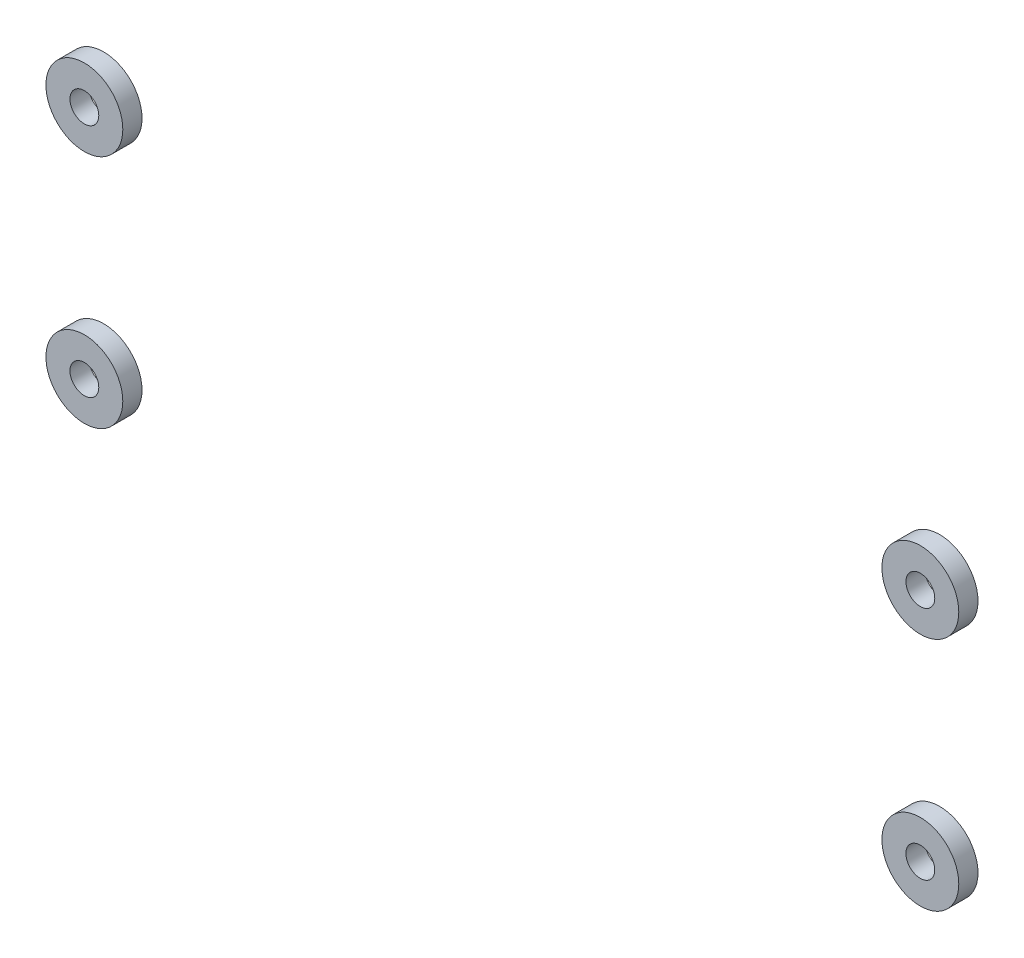
ISO-10303-21;
HEADER;
FILE_DESCRIPTION(('STEP AP214'),'2;1');
FILE_NAME('part.step','',(''),(''),'','','');
FILE_SCHEMA(('AUTOMOTIVE_DESIGN { 1 0 10303 214 1 1 1 1 }'));
ENDSEC;
DATA;
#1=APPLICATION_CONTEXT('core data for automotive mechanical design processes');
#2=APPLICATION_PROTOCOL_DEFINITION('international standard','automotive_design',2000,#1);
#3=PRODUCT_CONTEXT('',#1,'mechanical');
#4=PRODUCT('Part','Part','',(#3));
#5=PRODUCT_RELATED_PRODUCT_CATEGORY('part','',(#4));
#6=PRODUCT_DEFINITION_FORMATION('','',#4);
#7=PRODUCT_DEFINITION_CONTEXT('part definition',#1,'design');
#8=PRODUCT_DEFINITION('design','',#6,#7);
#9=PRODUCT_DEFINITION_SHAPE('','',#8);
#10=(LENGTH_UNIT() NAMED_UNIT(*) SI_UNIT(.MILLI.,.METRE.));
#11=(NAMED_UNIT(*) PLANE_ANGLE_UNIT() SI_UNIT($,.RADIAN.));
#12=(NAMED_UNIT(*) SI_UNIT($,.STERADIAN.) SOLID_ANGLE_UNIT());
#13=UNCERTAINTY_MEASURE_WITH_UNIT(LENGTH_MEASURE(1.E-05),#10,'distance_accuracy_value','');
#14=(GEOMETRIC_REPRESENTATION_CONTEXT(3) GLOBAL_UNCERTAINTY_ASSIGNED_CONTEXT((#13)) GLOBAL_UNIT_ASSIGNED_CONTEXT((#10,
#11,#12)) REPRESENTATION_CONTEXT('',''));
#15=CARTESIAN_POINT('',(0.,0.,0.));
#16=DIRECTION('',(0.,0.,1.));
#17=DIRECTION('',(1.,0.,0.));
#18=AXIS2_PLACEMENT_3D('',#15,#16,#17);
#19=CARTESIAN_POINT('',(-43.5,12.25,2.));
#20=DIRECTION('',(0.,0.,1.));
#21=DIRECTION('',(1.,0.,0.));
#22=AXIS2_PLACEMENT_3D('',#19,#20,#21);
#23=PLANE('',#22);
#24=CARTESIAN_POINT('',(-43.5,12.25,2.));
#25=DIRECTION('',(0.,0.,1.));
#26=DIRECTION('',(1.,0.,0.));
#27=AXIS2_PLACEMENT_3D('',#24,#25,#26);
#28=CIRCLE('',#27,4.);
#29=CARTESIAN_POINT('',(-39.5,12.25,2.));
#30=VERTEX_POINT('',#29);
#31=EDGE_CURVE('E56',#30,#30,#28,.T.);
#32=ORIENTED_EDGE('',*,*,#31,.T.);
#33=EDGE_LOOP('',(#32));
#34=FACE_BOUND('',#33,.T.);
#35=CARTESIAN_POINT('',(-43.5,12.25,2.));
#36=DIRECTION('',(0.,0.,1.));
#37=DIRECTION('',(1.,0.,0.));
#38=AXIS2_PLACEMENT_3D('',#35,#36,#37);
#39=CIRCLE('',#38,1.5);
#40=CARTESIAN_POINT('',(-42.,12.25,2.));
#41=VERTEX_POINT('',#40);
#42=EDGE_CURVE('E47',#41,#41,#39,.T.);
#43=ORIENTED_EDGE('',*,*,#42,.F.);
#44=EDGE_LOOP('',(#43));
#45=FACE_BOUND('',#44,.T.);
#46=ADVANCED_FACE('F43',(#34,#45),#23,.T.);
#47=CARTESIAN_POINT('',(-43.5,12.25,0.));
#48=DIRECTION('',(0.,0.,1.));
#49=DIRECTION('',(1.,0.,0.));
#50=AXIS2_PLACEMENT_3D('',#47,#48,#49);
#51=PLANE('',#50);
#52=CARTESIAN_POINT('',(-43.5,12.25,0.));
#53=DIRECTION('',(0.,0.,1.));
#54=DIRECTION('',(1.,0.,0.));
#55=AXIS2_PLACEMENT_3D('',#52,#53,#54);
#56=CIRCLE('',#55,4.);
#57=CARTESIAN_POINT('',(-39.5,12.25,0.));
#58=VERTEX_POINT('',#57);
#59=EDGE_CURVE('E54',#58,#58,#56,.T.);
#60=ORIENTED_EDGE('',*,*,#59,.F.);
#61=EDGE_LOOP('',(#60));
#62=FACE_BOUND('',#61,.T.);
#63=CARTESIAN_POINT('',(-43.5,12.25,0.));
#64=DIRECTION('',(0.,0.,1.));
#65=DIRECTION('',(1.,0.,0.));
#66=AXIS2_PLACEMENT_3D('',#63,#64,#65);
#67=CIRCLE('',#66,1.5);
#68=CARTESIAN_POINT('',(-42.,12.25,0.));
#69=VERTEX_POINT('',#68);
#70=EDGE_CURVE('E11',#69,#69,#67,.T.);
#71=ORIENTED_EDGE('',*,*,#70,.T.);
#72=EDGE_LOOP('',(#71));
#73=FACE_BOUND('',#72,.T.);
#74=ADVANCED_FACE('F64',(#62,#73),#51,.F.);
#75=CARTESIAN_POINT('',(-43.5,12.25,2.));
#76=DIRECTION('',(0.,0.,-1.));
#77=DIRECTION('',(-1.,0.,0.));
#78=AXIS2_PLACEMENT_3D('',#75,#76,#77);
#79=CYLINDRICAL_SURFACE('',#78,4.);
#80=ORIENTED_EDGE('',*,*,#31,.F.);
#81=EDGE_LOOP('',(#80));
#82=FACE_BOUND('',#81,.T.);
#83=ORIENTED_EDGE('',*,*,#59,.T.);
#84=EDGE_LOOP('',(#83));
#85=FACE_BOUND('',#84,.T.);
#86=ADVANCED_FACE('F62',(#82,#85),#79,.T.);
#87=CARTESIAN_POINT('',(-43.5,12.25,2.));
#88=DIRECTION('',(0.,0.,-1.));
#89=DIRECTION('',(-1.,0.,0.));
#90=AXIS2_PLACEMENT_3D('',#87,#88,#89);
#91=CYLINDRICAL_SURFACE('',#90,1.5);
#92=ORIENTED_EDGE('',*,*,#42,.T.);
#93=EDGE_LOOP('',(#92));
#94=FACE_BOUND('',#93,.T.);
#95=ORIENTED_EDGE('',*,*,#70,.F.);
#96=EDGE_LOOP('',(#95));
#97=FACE_BOUND('',#96,.T.);
#98=ADVANCED_FACE('F45',(#94,#97),#91,.F.);
#99=CLOSED_SHELL('',(#46,#74,#86,#98));
#100=MANIFOLD_SOLID_BREP('B2',#99);
#101=CARTESIAN_POINT('',(-43.5,-12.25,2.));
#102=DIRECTION('',(0.,0.,1.));
#103=DIRECTION('',(1.,0.,0.));
#104=AXIS2_PLACEMENT_3D('',#101,#102,#103);
#105=PLANE('',#104);
#106=CARTESIAN_POINT('',(-43.5,-12.25,2.));
#107=DIRECTION('',(0.,0.,1.));
#108=DIRECTION('',(1.,0.,0.));
#109=AXIS2_PLACEMENT_3D('',#106,#107,#108);
#110=CIRCLE('',#109,4.);
#111=CARTESIAN_POINT('',(-39.5,-12.25,2.));
#112=VERTEX_POINT('',#111);
#113=EDGE_CURVE('E133',#112,#112,#110,.T.);
#114=ORIENTED_EDGE('',*,*,#113,.T.);
#115=EDGE_LOOP('',(#114));
#116=FACE_BOUND('',#115,.T.);
#117=CARTESIAN_POINT('',(-43.5,-12.25,2.));
#118=DIRECTION('',(0.,0.,1.));
#119=DIRECTION('',(1.,0.,0.));
#120=AXIS2_PLACEMENT_3D('',#117,#118,#119);
#121=CIRCLE('',#120,1.5);
#122=CARTESIAN_POINT('',(-42.,-12.25,2.));
#123=VERTEX_POINT('',#122);
#124=EDGE_CURVE('E124',#123,#123,#121,.T.);
#125=ORIENTED_EDGE('',*,*,#124,.F.);
#126=EDGE_LOOP('',(#125));
#127=FACE_BOUND('',#126,.T.);
#128=ADVANCED_FACE('F120',(#116,#127),#105,.T.);
#129=CARTESIAN_POINT('',(-43.5,-12.25,0.));
#130=DIRECTION('',(0.,0.,1.));
#131=DIRECTION('',(1.,0.,0.));
#132=AXIS2_PLACEMENT_3D('',#129,#130,#131);
#133=PLANE('',#132);
#134=CARTESIAN_POINT('',(-43.5,-12.25,0.));
#135=DIRECTION('',(0.,0.,1.));
#136=DIRECTION('',(1.,0.,0.));
#137=AXIS2_PLACEMENT_3D('',#134,#135,#136);
#138=CIRCLE('',#137,4.);
#139=CARTESIAN_POINT('',(-39.5,-12.25,0.));
#140=VERTEX_POINT('',#139);
#141=EDGE_CURVE('E131',#140,#140,#138,.T.);
#142=ORIENTED_EDGE('',*,*,#141,.F.);
#143=EDGE_LOOP('',(#142));
#144=FACE_BOUND('',#143,.T.);
#145=CARTESIAN_POINT('',(-43.5,-12.25,0.));
#146=DIRECTION('',(0.,0.,1.));
#147=DIRECTION('',(1.,0.,0.));
#148=AXIS2_PLACEMENT_3D('',#145,#146,#147);
#149=CIRCLE('',#148,1.5);
#150=CARTESIAN_POINT('',(-42.,-12.25,0.));
#151=VERTEX_POINT('',#150);
#152=EDGE_CURVE('E42',#151,#151,#149,.T.);
#153=ORIENTED_EDGE('',*,*,#152,.T.);
#154=EDGE_LOOP('',(#153));
#155=FACE_BOUND('',#154,.T.);
#156=ADVANCED_FACE('F141',(#144,#155),#133,.F.);
#157=CARTESIAN_POINT('',(-43.5,-12.25,2.));
#158=DIRECTION('',(0.,0.,-1.));
#159=DIRECTION('',(-1.,0.,0.));
#160=AXIS2_PLACEMENT_3D('',#157,#158,#159);
#161=CYLINDRICAL_SURFACE('',#160,4.);
#162=ORIENTED_EDGE('',*,*,#113,.F.);
#163=EDGE_LOOP('',(#162));
#164=FACE_BOUND('',#163,.T.);
#165=ORIENTED_EDGE('',*,*,#141,.T.);
#166=EDGE_LOOP('',(#165));
#167=FACE_BOUND('',#166,.T.);
#168=ADVANCED_FACE('F139',(#164,#167),#161,.T.);
#169=CARTESIAN_POINT('',(-43.5,-12.25,2.));
#170=DIRECTION('',(0.,0.,-1.));
#171=DIRECTION('',(-1.,0.,0.));
#172=AXIS2_PLACEMENT_3D('',#169,#170,#171);
#173=CYLINDRICAL_SURFACE('',#172,1.5);
#174=ORIENTED_EDGE('',*,*,#124,.T.);
#175=EDGE_LOOP('',(#174));
#176=FACE_BOUND('',#175,.T.);
#177=ORIENTED_EDGE('',*,*,#152,.F.);
#178=EDGE_LOOP('',(#177));
#179=FACE_BOUND('',#178,.T.);
#180=ADVANCED_FACE('F122',(#176,#179),#173,.F.);
#181=CLOSED_SHELL('',(#128,#156,#168,#180));
#182=MANIFOLD_SOLID_BREP('B6',#181);
#183=CARTESIAN_POINT('',(43.5,12.25,2.));
#184=DIRECTION('',(0.,0.,1.));
#185=DIRECTION('',(1.,0.,0.));
#186=AXIS2_PLACEMENT_3D('',#183,#184,#185);
#187=PLANE('',#186);
#188=CARTESIAN_POINT('',(43.5,12.25,2.));
#189=DIRECTION('',(0.,0.,1.));
#190=DIRECTION('',(1.,0.,0.));
#191=AXIS2_PLACEMENT_3D('',#188,#189,#190);
#192=CIRCLE('',#191,4.);
#193=CARTESIAN_POINT('',(47.5,12.25,2.));
#194=VERTEX_POINT('',#193);
#195=EDGE_CURVE('E209',#194,#194,#192,.T.);
#196=ORIENTED_EDGE('',*,*,#195,.T.);
#197=EDGE_LOOP('',(#196));
#198=FACE_BOUND('',#197,.T.);
#199=CARTESIAN_POINT('',(43.5,12.25,2.));
#200=DIRECTION('',(0.,0.,1.));
#201=DIRECTION('',(1.,0.,0.));
#202=AXIS2_PLACEMENT_3D('',#199,#200,#201);
#203=CIRCLE('',#202,1.5);
#204=CARTESIAN_POINT('',(45.,12.25,2.));
#205=VERTEX_POINT('',#204);
#206=EDGE_CURVE('E200',#205,#205,#203,.T.);
#207=ORIENTED_EDGE('',*,*,#206,.F.);
#208=EDGE_LOOP('',(#207));
#209=FACE_BOUND('',#208,.T.);
#210=ADVANCED_FACE('F196',(#198,#209),#187,.T.);
#211=CARTESIAN_POINT('',(43.5,12.25,0.));
#212=DIRECTION('',(0.,0.,1.));
#213=DIRECTION('',(1.,0.,0.));
#214=AXIS2_PLACEMENT_3D('',#211,#212,#213);
#215=PLANE('',#214);
#216=CARTESIAN_POINT('',(43.5,12.25,0.));
#217=DIRECTION('',(0.,0.,1.));
#218=DIRECTION('',(1.,0.,0.));
#219=AXIS2_PLACEMENT_3D('',#216,#217,#218);
#220=CIRCLE('',#219,4.);
#221=CARTESIAN_POINT('',(47.5,12.25,0.));
#222=VERTEX_POINT('',#221);
#223=EDGE_CURVE('E207',#222,#222,#220,.T.);
#224=ORIENTED_EDGE('',*,*,#223,.F.);
#225=EDGE_LOOP('',(#224));
#226=FACE_BOUND('',#225,.T.);
#227=CARTESIAN_POINT('',(43.5,12.25,0.));
#228=DIRECTION('',(0.,0.,1.));
#229=DIRECTION('',(1.,0.,0.));
#230=AXIS2_PLACEMENT_3D('',#227,#228,#229);
#231=CIRCLE('',#230,1.5);
#232=CARTESIAN_POINT('',(45.,12.25,0.));
#233=VERTEX_POINT('',#232);
#234=EDGE_CURVE('E119',#233,#233,#231,.T.);
#235=ORIENTED_EDGE('',*,*,#234,.T.);
#236=EDGE_LOOP('',(#235));
#237=FACE_BOUND('',#236,.T.);
#238=ADVANCED_FACE('F217',(#226,#237),#215,.F.);
#239=CARTESIAN_POINT('',(43.5,12.25,2.));
#240=DIRECTION('',(0.,0.,-1.));
#241=DIRECTION('',(-1.,0.,0.));
#242=AXIS2_PLACEMENT_3D('',#239,#240,#241);
#243=CYLINDRICAL_SURFACE('',#242,4.);
#244=ORIENTED_EDGE('',*,*,#195,.F.);
#245=EDGE_LOOP('',(#244));
#246=FACE_BOUND('',#245,.T.);
#247=ORIENTED_EDGE('',*,*,#223,.T.);
#248=EDGE_LOOP('',(#247));
#249=FACE_BOUND('',#248,.T.);
#250=ADVANCED_FACE('F215',(#246,#249),#243,.T.);
#251=CARTESIAN_POINT('',(43.5,12.25,2.));
#252=DIRECTION('',(0.,0.,-1.));
#253=DIRECTION('',(-1.,0.,0.));
#254=AXIS2_PLACEMENT_3D('',#251,#252,#253);
#255=CYLINDRICAL_SURFACE('',#254,1.5);
#256=ORIENTED_EDGE('',*,*,#206,.T.);
#257=EDGE_LOOP('',(#256));
#258=FACE_BOUND('',#257,.T.);
#259=ORIENTED_EDGE('',*,*,#234,.F.);
#260=EDGE_LOOP('',(#259));
#261=FACE_BOUND('',#260,.T.);
#262=ADVANCED_FACE('F198',(#258,#261),#255,.F.);
#263=CLOSED_SHELL('',(#210,#238,#250,#262));
#264=MANIFOLD_SOLID_BREP('B37',#263);
#265=CARTESIAN_POINT('',(43.5,-12.25,2.));
#266=DIRECTION('',(0.,0.,1.));
#267=DIRECTION('',(1.,0.,0.));
#268=AXIS2_PLACEMENT_3D('',#265,#266,#267);
#269=PLANE('',#268);
#270=CARTESIAN_POINT('',(43.5,-12.25,2.));
#271=DIRECTION('',(0.,0.,1.));
#272=DIRECTION('',(1.,0.,0.));
#273=AXIS2_PLACEMENT_3D('',#270,#271,#272);
#274=CIRCLE('',#273,4.);
#275=CARTESIAN_POINT('',(47.5,-12.25,2.));
#276=VERTEX_POINT('',#275);
#277=EDGE_CURVE('E195',#276,#276,#274,.T.);
#278=ORIENTED_EDGE('',*,*,#277,.T.);
#279=EDGE_LOOP('',(#278));
#280=FACE_BOUND('',#279,.T.);
#281=CARTESIAN_POINT('',(43.5,-12.25,2.));
#282=DIRECTION('',(0.,0.,1.));
#283=DIRECTION('',(1.,0.,0.));
#284=AXIS2_PLACEMENT_3D('',#281,#282,#283);
#285=CIRCLE('',#284,1.5);
#286=CARTESIAN_POINT('',(45.,-12.25,2.));
#287=VERTEX_POINT('',#286);
#288=EDGE_CURVE('E276',#287,#287,#285,.T.);
#289=ORIENTED_EDGE('',*,*,#288,.F.);
#290=EDGE_LOOP('',(#289));
#291=FACE_BOUND('',#290,.T.);
#292=ADVANCED_FACE('F265',(#280,#291),#269,.T.);
#293=CARTESIAN_POINT('',(43.5,-12.25,0.));
#294=DIRECTION('',(0.,0.,1.));
#295=DIRECTION('',(1.,0.,0.));
#296=AXIS2_PLACEMENT_3D('',#293,#294,#295);
#297=PLANE('',#296);
#298=CARTESIAN_POINT('',(43.5,-12.25,0.));
#299=DIRECTION('',(0.,0.,1.));
#300=DIRECTION('',(1.,0.,0.));
#301=AXIS2_PLACEMENT_3D('',#298,#299,#300);
#302=CIRCLE('',#301,4.);
#303=CARTESIAN_POINT('',(47.5,-12.25,0.));
#304=VERTEX_POINT('',#303);
#305=EDGE_CURVE('E269',#304,#304,#302,.T.);
#306=ORIENTED_EDGE('',*,*,#305,.F.);
#307=EDGE_LOOP('',(#306));
#308=FACE_BOUND('',#307,.T.);
#309=CARTESIAN_POINT('',(43.5,-12.25,0.));
#310=DIRECTION('',(0.,0.,1.));
#311=DIRECTION('',(1.,0.,0.));
#312=AXIS2_PLACEMENT_3D('',#309,#310,#311);
#313=CIRCLE('',#312,1.5);
#314=CARTESIAN_POINT('',(45.,-12.25,0.));
#315=VERTEX_POINT('',#314);
#316=EDGE_CURVE('E278',#315,#315,#313,.T.);
#317=ORIENTED_EDGE('',*,*,#316,.T.);
#318=EDGE_LOOP('',(#317));
#319=FACE_BOUND('',#318,.T.);
#320=ADVANCED_FACE('F288',(#308,#319),#297,.F.);
#321=CARTESIAN_POINT('',(43.5,-12.25,2.));
#322=DIRECTION('',(0.,0.,-1.));
#323=DIRECTION('',(-1.,0.,0.));
#324=AXIS2_PLACEMENT_3D('',#321,#322,#323);
#325=CYLINDRICAL_SURFACE('',#324,4.);
#326=ORIENTED_EDGE('',*,*,#277,.F.);
#327=EDGE_LOOP('',(#326));
#328=FACE_BOUND('',#327,.T.);
#329=ORIENTED_EDGE('',*,*,#305,.T.);
#330=EDGE_LOOP('',(#329));
#331=FACE_BOUND('',#330,.T.);
#332=ADVANCED_FACE('F267',(#328,#331),#325,.T.);
#333=CARTESIAN_POINT('',(43.5,-12.25,2.));
#334=DIRECTION('',(0.,0.,-1.));
#335=DIRECTION('',(-1.,0.,0.));
#336=AXIS2_PLACEMENT_3D('',#333,#334,#335);
#337=CYLINDRICAL_SURFACE('',#336,1.5);
#338=ORIENTED_EDGE('',*,*,#288,.T.);
#339=EDGE_LOOP('',(#338));
#340=FACE_BOUND('',#339,.T.);
#341=ORIENTED_EDGE('',*,*,#316,.F.);
#342=EDGE_LOOP('',(#341));
#343=FACE_BOUND('',#342,.T.);
#344=ADVANCED_FACE('F284',(#340,#343),#337,.F.);
#345=CLOSED_SHELL('',(#292,#320,#332,#344));
#346=MANIFOLD_SOLID_BREP('B114',#345);
#347=ADVANCED_BREP_SHAPE_REPRESENTATION('',(#18,#100,#182,#264,#346),#14);
#348=SHAPE_DEFINITION_REPRESENTATION(#9,#347);
ENDSEC;
END-ISO-10303-21;
